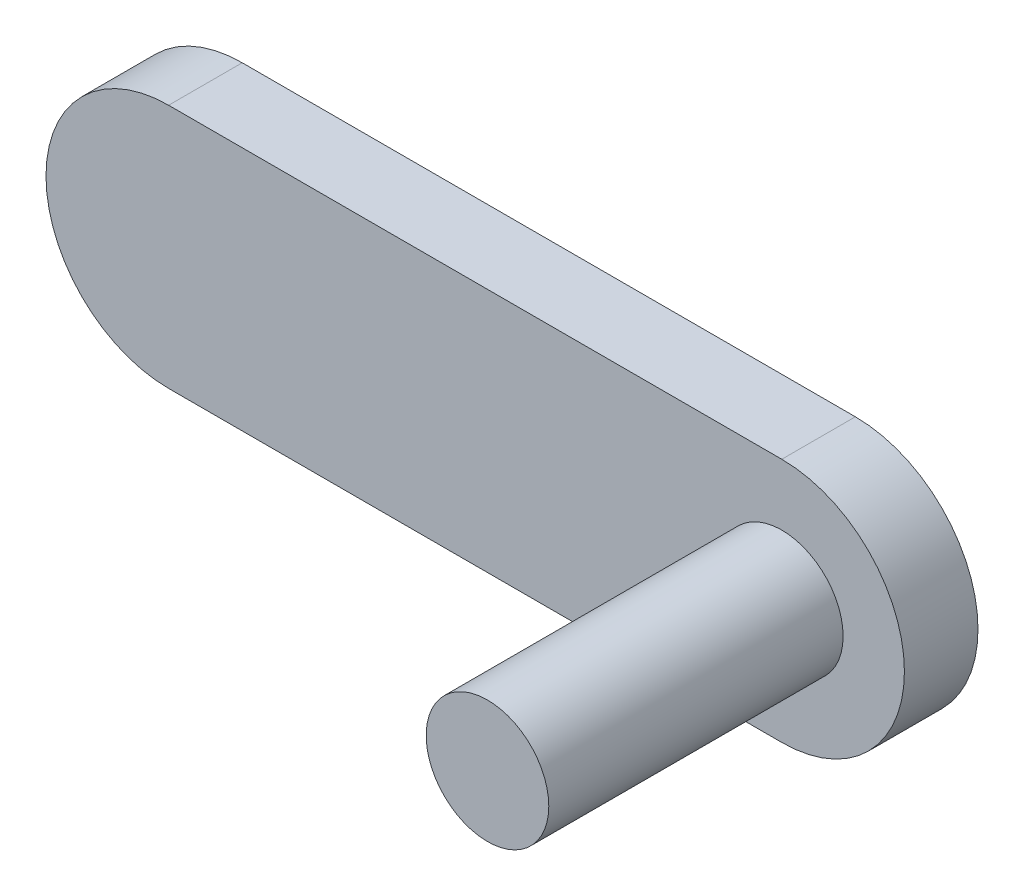
ISO-10303-21;
HEADER;
FILE_DESCRIPTION(('STEP AP214'),'2;1');
FILE_NAME('part.step','',(''),(''),'','','');
FILE_SCHEMA(('AUTOMOTIVE_DESIGN { 1 0 10303 214 1 1 1 1 }'));
ENDSEC;
DATA;
#1=APPLICATION_CONTEXT('core data for automotive mechanical design processes');
#2=APPLICATION_PROTOCOL_DEFINITION('international standard','automotive_design',2000,#1);
#3=PRODUCT_CONTEXT('',#1,'mechanical');
#4=PRODUCT('Part','Part','',(#3));
#5=PRODUCT_RELATED_PRODUCT_CATEGORY('part','',(#4));
#6=PRODUCT_DEFINITION_FORMATION('','',#4);
#7=PRODUCT_DEFINITION_CONTEXT('part definition',#1,'design');
#8=PRODUCT_DEFINITION('design','',#6,#7);
#9=PRODUCT_DEFINITION_SHAPE('','',#8);
#10=(LENGTH_UNIT() NAMED_UNIT(*) SI_UNIT(.MILLI.,.METRE.));
#11=(NAMED_UNIT(*) PLANE_ANGLE_UNIT() SI_UNIT($,.RADIAN.));
#12=(NAMED_UNIT(*) SI_UNIT($,.STERADIAN.) SOLID_ANGLE_UNIT());
#13=UNCERTAINTY_MEASURE_WITH_UNIT(LENGTH_MEASURE(1.E-05),#10,'distance_accuracy_value','');
#14=(GEOMETRIC_REPRESENTATION_CONTEXT(3) GLOBAL_UNCERTAINTY_ASSIGNED_CONTEXT((#13)) GLOBAL_UNIT_ASSIGNED_CONTEXT((#10,
#11,#12)) REPRESENTATION_CONTEXT('',''));
#15=CARTESIAN_POINT('',(0.,0.,0.));
#16=DIRECTION('',(0.,0.,1.));
#17=DIRECTION('',(1.,0.,0.));
#18=AXIS2_PLACEMENT_3D('',#15,#16,#17);
#19=CARTESIAN_POINT('',(0.,-5.,3.));
#20=DIRECTION('',(0.,1.,0.));
#21=DIRECTION('',(0.,0.,1.));
#22=AXIS2_PLACEMENT_3D('',#19,#20,#21);
#23=PLANE('',#22);
#24=DIRECTION('',(1.,0.,0.));
#25=VECTOR('',#24,1.);
#26=CARTESIAN_POINT('',(0.,-5.,0.));
#27=LINE('',#26,#25);
#28=CARTESIAN_POINT('',(0.,-5.,0.));
#29=VERTEX_POINT('',#28);
#30=CARTESIAN_POINT('',(25.,-5.,0.));
#31=VERTEX_POINT('',#30);
#32=EDGE_CURVE('E96',#29,#31,#27,.T.);
#33=ORIENTED_EDGE('',*,*,#32,.T.);
#34=DIRECTION('',(0.,0.,-1.));
#35=VECTOR('',#34,1.);
#36=CARTESIAN_POINT('',(25.,-5.,3.));
#37=LINE('',#36,#35);
#38=CARTESIAN_POINT('',(25.,-5.,3.));
#39=VERTEX_POINT('',#38);
#40=EDGE_CURVE('E11',#39,#31,#37,.T.);
#41=ORIENTED_EDGE('',*,*,#40,.F.);
#42=DIRECTION('',(1.,0.,0.));
#43=VECTOR('',#42,1.);
#44=CARTESIAN_POINT('',(0.,-5.,3.));
#45=LINE('',#44,#43);
#46=CARTESIAN_POINT('',(0.,-5.,3.));
#47=VERTEX_POINT('',#46);
#48=EDGE_CURVE('E81',#47,#39,#45,.T.);
#49=ORIENTED_EDGE('',*,*,#48,.F.);
#50=DIRECTION('',(0.,0.,-1.));
#51=VECTOR('',#50,1.);
#52=CARTESIAN_POINT('',(0.,-5.,3.));
#53=LINE('',#52,#51);
#54=EDGE_CURVE('E92',#47,#29,#53,.T.);
#55=ORIENTED_EDGE('',*,*,#54,.T.);
#56=EDGE_LOOP('',(#33,#41,#49,#55));
#57=FACE_BOUND('',#56,.T.);
#58=ADVANCED_FACE('F34',(#57),#23,.F.);
#59=CARTESIAN_POINT('',(25.,0.,3.));
#60=DIRECTION('',(0.,0.,-1.));
#61=DIRECTION('',(-1.,0.,0.));
#62=AXIS2_PLACEMENT_3D('',#59,#60,#61);
#63=CYLINDRICAL_SURFACE('',#62,5.);
#64=CARTESIAN_POINT('',(25.,0.,0.));
#65=DIRECTION('',(0.,0.,1.));
#66=DIRECTION('',(1.,0.,0.));
#67=AXIS2_PLACEMENT_3D('',#64,#65,#66);
#68=CIRCLE('',#67,5.);
#69=CARTESIAN_POINT('',(25.,5.,0.));
#70=VERTEX_POINT('',#69);
#71=EDGE_CURVE('E86',#31,#70,#68,.T.);
#72=ORIENTED_EDGE('',*,*,#71,.T.);
#73=DIRECTION('',(0.,0.,-1.));
#74=VECTOR('',#73,1.);
#75=CARTESIAN_POINT('',(25.,5.,3.));
#76=LINE('',#75,#74);
#77=CARTESIAN_POINT('',(25.,5.,3.));
#78=VERTEX_POINT('',#77);
#79=EDGE_CURVE('E42',#78,#70,#76,.T.);
#80=ORIENTED_EDGE('',*,*,#79,.F.);
#81=CARTESIAN_POINT('',(25.,0.,3.));
#82=DIRECTION('',(0.,0.,1.));
#83=DIRECTION('',(1.,0.,0.));
#84=AXIS2_PLACEMENT_3D('',#81,#82,#83);
#85=CIRCLE('',#84,5.);
#86=EDGE_CURVE('E76',#39,#78,#85,.T.);
#87=ORIENTED_EDGE('',*,*,#86,.F.);
#88=ORIENTED_EDGE('',*,*,#40,.T.);
#89=EDGE_LOOP('',(#72,#80,#87,#88));
#90=FACE_BOUND('',#89,.T.);
#91=ADVANCED_FACE('F85',(#90),#63,.T.);
#92=CARTESIAN_POINT('',(0.,5.,3.));
#93=DIRECTION('',(0.,1.,0.));
#94=DIRECTION('',(0.,0.,1.));
#95=AXIS2_PLACEMENT_3D('',#92,#93,#94);
#96=PLANE('',#95);
#97=DIRECTION('',(1.,0.,0.));
#98=VECTOR('',#97,1.);
#99=CARTESIAN_POINT('',(0.,5.,0.));
#100=LINE('',#99,#98);
#101=CARTESIAN_POINT('',(0.,5.,0.));
#102=VERTEX_POINT('',#101);
#103=EDGE_CURVE('E101',#102,#70,#100,.T.);
#104=ORIENTED_EDGE('',*,*,#103,.F.);
#105=DIRECTION('',(0.,0.,-1.));
#106=VECTOR('',#105,1.);
#107=CARTESIAN_POINT('',(0.,5.,3.));
#108=LINE('',#107,#106);
#109=CARTESIAN_POINT('',(0.,5.,3.));
#110=VERTEX_POINT('',#109);
#111=EDGE_CURVE('E66',#110,#102,#108,.T.);
#112=ORIENTED_EDGE('',*,*,#111,.F.);
#113=DIRECTION('',(1.,0.,0.));
#114=VECTOR('',#113,1.);
#115=CARTESIAN_POINT('',(0.,5.,3.));
#116=LINE('',#115,#114);
#117=EDGE_CURVE('E79',#110,#78,#116,.T.);
#118=ORIENTED_EDGE('',*,*,#117,.T.);
#119=ORIENTED_EDGE('',*,*,#79,.T.);
#120=EDGE_LOOP('',(#104,#112,#118,#119));
#121=FACE_BOUND('',#120,.T.);
#122=ADVANCED_FACE('F90',(#121),#96,.T.);
#123=CARTESIAN_POINT('',(0.,0.,3.));
#124=DIRECTION('',(0.,0.,-1.));
#125=DIRECTION('',(-1.,0.,0.));
#126=AXIS2_PLACEMENT_3D('',#123,#124,#125);
#127=CYLINDRICAL_SURFACE('',#126,5.);
#128=CARTESIAN_POINT('',(0.,0.,0.));
#129=DIRECTION('',(0.,0.,1.));
#130=DIRECTION('',(1.,0.,0.));
#131=AXIS2_PLACEMENT_3D('',#128,#129,#130);
#132=CIRCLE('',#131,5.);
#133=EDGE_CURVE('E69',#102,#29,#132,.T.);
#134=ORIENTED_EDGE('',*,*,#133,.T.);
#135=ORIENTED_EDGE('',*,*,#54,.F.);
#136=CARTESIAN_POINT('',(0.,0.,3.));
#137=DIRECTION('',(0.,0.,1.));
#138=DIRECTION('',(1.,0.,0.));
#139=AXIS2_PLACEMENT_3D('',#136,#137,#138);
#140=CIRCLE('',#139,5.);
#141=EDGE_CURVE('E50',#110,#47,#140,.T.);
#142=ORIENTED_EDGE('',*,*,#141,.F.);
#143=ORIENTED_EDGE('',*,*,#111,.T.);
#144=EDGE_LOOP('',(#134,#135,#142,#143));
#145=FACE_BOUND('',#144,.T.);
#146=ADVANCED_FACE('F119',(#145),#127,.T.);
#147=CARTESIAN_POINT('',(0.,0.,3.));
#148=DIRECTION('',(0.,0.,1.));
#149=DIRECTION('',(1.,0.,0.));
#150=AXIS2_PLACEMENT_3D('',#147,#148,#149);
#151=PLANE('',#150);
#152=CARTESIAN_POINT('',(25.,0.,3.));
#153=DIRECTION('',(0.,0.,1.));
#154=DIRECTION('',(1.,0.,0.));
#155=AXIS2_PLACEMENT_3D('',#152,#153,#154);
#156=CIRCLE('',#155,2.5);
#157=CARTESIAN_POINT('',(27.5,0.,3.));
#158=VERTEX_POINT('',#157);
#159=EDGE_CURVE('E99',#158,#158,#156,.F.);
#160=ORIENTED_EDGE('',*,*,#159,.T.);
#161=EDGE_LOOP('',(#160));
#162=FACE_BOUND('',#161,.T.);
#163=ORIENTED_EDGE('',*,*,#48,.T.);
#164=ORIENTED_EDGE('',*,*,#86,.T.);
#165=ORIENTED_EDGE('',*,*,#117,.F.);
#166=ORIENTED_EDGE('',*,*,#141,.T.);
#167=EDGE_LOOP('',(#163,#164,#165,#166));
#168=FACE_BOUND('',#167,.T.);
#169=ADVANCED_FACE('F77',(#162,#168),#151,.T.);
#170=CARTESIAN_POINT('',(0.,0.,0.));
#171=DIRECTION('',(0.,0.,1.));
#172=DIRECTION('',(1.,0.,0.));
#173=AXIS2_PLACEMENT_3D('',#170,#171,#172);
#174=PLANE('',#173);
#175=ORIENTED_EDGE('',*,*,#32,.F.);
#176=ORIENTED_EDGE('',*,*,#133,.F.);
#177=ORIENTED_EDGE('',*,*,#103,.T.);
#178=ORIENTED_EDGE('',*,*,#71,.F.);
#179=EDGE_LOOP('',(#175,#176,#177,#178));
#180=FACE_BOUND('',#179,.T.);
#181=ADVANCED_FACE('F108',(#180),#174,.F.);
#182=CARTESIAN_POINT('',(25.,0.,15.));
#183=DIRECTION('',(0.,0.,-1.));
#184=DIRECTION('',(-1.,0.,0.));
#185=AXIS2_PLACEMENT_3D('',#182,#183,#184);
#186=CYLINDRICAL_SURFACE('',#185,2.5);
#187=ORIENTED_EDGE('',*,*,#159,.F.);
#188=EDGE_LOOP('',(#187));
#189=FACE_BOUND('',#188,.T.);
#190=CARTESIAN_POINT('',(25.,0.,15.));
#191=DIRECTION('',(0.,0.,1.));
#192=DIRECTION('',(1.,0.,0.));
#193=AXIS2_PLACEMENT_3D('',#190,#191,#192);
#194=CIRCLE('',#193,2.5);
#195=CARTESIAN_POINT('',(27.5,0.,15.));
#196=VERTEX_POINT('',#195);
#197=EDGE_CURVE('E165',#196,#196,#194,.T.);
#198=ORIENTED_EDGE('',*,*,#197,.F.);
#199=EDGE_LOOP('',(#198));
#200=FACE_BOUND('',#199,.T.);
#201=ADVANCED_FACE('F110',(#189,#200),#186,.T.);
#202=CARTESIAN_POINT('',(0.,0.,15.));
#203=DIRECTION('',(0.,0.,1.));
#204=DIRECTION('',(1.,0.,0.));
#205=AXIS2_PLACEMENT_3D('',#202,#203,#204);
#206=PLANE('',#205);
#207=ORIENTED_EDGE('',*,*,#197,.T.);
#208=EDGE_LOOP('',(#207));
#209=FACE_BOUND('',#208,.T.);
#210=ADVANCED_FACE('F116',(#209),#206,.T.);
#211=CLOSED_SHELL('',(#58,#91,#122,#146,#169,#181,#201,#210));
#212=MANIFOLD_SOLID_BREP('B2',#211);
#213=ADVANCED_BREP_SHAPE_REPRESENTATION('',(#18,#212),#14);
#214=SHAPE_DEFINITION_REPRESENTATION(#9,#213);
ENDSEC;
END-ISO-10303-21;
